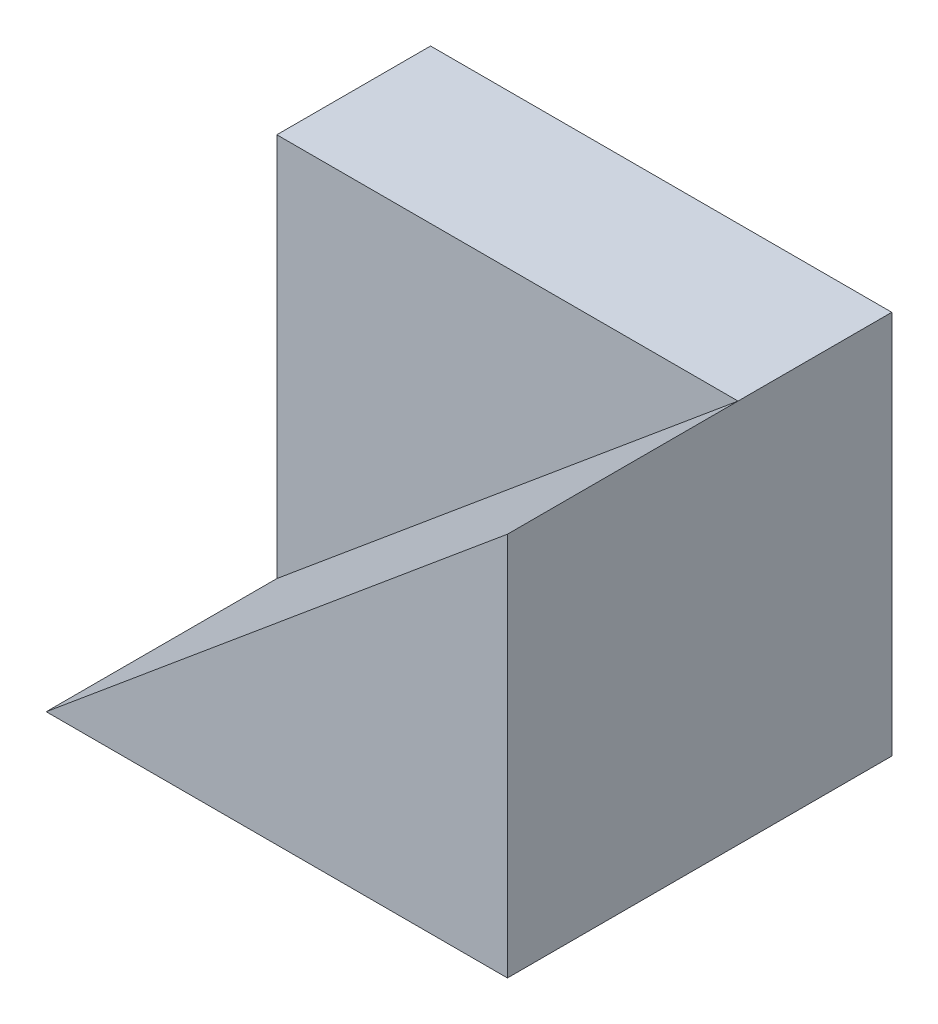
ISO-10303-21;
HEADER;
FILE_DESCRIPTION(('STEP AP214'),'2;1');
FILE_NAME('part.step','',(''),(''),'','','');
FILE_SCHEMA(('AUTOMOTIVE_DESIGN { 1 0 10303 214 1 1 1 1 }'));
ENDSEC;
DATA;
#1=APPLICATION_CONTEXT('core data for automotive mechanical design processes');
#2=APPLICATION_PROTOCOL_DEFINITION('international standard','automotive_design',2000,#1);
#3=PRODUCT_CONTEXT('',#1,'mechanical');
#4=PRODUCT('Part','Part','',(#3));
#5=PRODUCT_RELATED_PRODUCT_CATEGORY('part','',(#4));
#6=PRODUCT_DEFINITION_FORMATION('','',#4);
#7=PRODUCT_DEFINITION_CONTEXT('part definition',#1,'design');
#8=PRODUCT_DEFINITION('design','',#6,#7);
#9=PRODUCT_DEFINITION_SHAPE('','',#8);
#10=(LENGTH_UNIT() NAMED_UNIT(*) SI_UNIT(.MILLI.,.METRE.));
#11=(NAMED_UNIT(*) PLANE_ANGLE_UNIT() SI_UNIT($,.RADIAN.));
#12=(NAMED_UNIT(*) SI_UNIT($,.STERADIAN.) SOLID_ANGLE_UNIT());
#13=UNCERTAINTY_MEASURE_WITH_UNIT(LENGTH_MEASURE(1.E-05),#10,'distance_accuracy_value','');
#14=(GEOMETRIC_REPRESENTATION_CONTEXT(3) GLOBAL_UNCERTAINTY_ASSIGNED_CONTEXT((#13)) GLOBAL_UNIT_ASSIGNED_CONTEXT((#10,
#11,#12)) REPRESENTATION_CONTEXT('',''));
#15=CARTESIAN_POINT('',(0.,0.,0.));
#16=DIRECTION('',(0.,0.,1.));
#17=DIRECTION('',(1.,0.,0.));
#18=AXIS2_PLACEMENT_3D('',#15,#16,#17);
#19=CARTESIAN_POINT('',(0.,0.,10.));
#20=DIRECTION('',(0.,0.,-1.));
#21=DIRECTION('',(-1.,0.,0.));
#22=AXIS2_PLACEMENT_3D('',#19,#20,#21);
#23=PLANE('',#22);
#24=DIRECTION('',(-0.768221279597376,-0.64018439966448,0.));
#25=VECTOR('',#24,1.);
#26=CARTESIAN_POINT('',(-30.,0.,10.));
#27=LINE('',#26,#25);
#28=CARTESIAN_POINT('',(0.,25.,10.));
#29=VERTEX_POINT('',#28);
#30=CARTESIAN_POINT('',(-30.,0.,10.));
#31=VERTEX_POINT('',#30);
#32=EDGE_CURVE('E127',#29,#31,#27,.T.);
#33=ORIENTED_EDGE('',*,*,#32,.F.);
#34=DIRECTION('',(-1.,0.,0.));
#35=VECTOR('',#34,1.);
#36=CARTESIAN_POINT('',(-30.,25.,10.));
#37=LINE('',#36,#35);
#38=CARTESIAN_POINT('',(-30.,25.,10.));
#39=VERTEX_POINT('',#38);
#40=EDGE_CURVE('E50',#29,#39,#37,.T.);
#41=ORIENTED_EDGE('',*,*,#40,.T.);
#42=DIRECTION('',(0.,-1.,0.));
#43=VECTOR('',#42,1.);
#44=CARTESIAN_POINT('',(-30.,0.,10.));
#45=LINE('',#44,#43);
#46=EDGE_CURVE('E80',#39,#31,#45,.T.);
#47=ORIENTED_EDGE('',*,*,#46,.T.);
#48=EDGE_LOOP('',(#33,#41,#47));
#49=FACE_BOUND('',#48,.T.);
#50=ADVANCED_FACE('F33',(#49),#23,.F.);
#51=CARTESIAN_POINT('',(-30.,0.,10.));
#52=DIRECTION('',(1.,0.,0.));
#53=DIRECTION('',(0.,1.,0.));
#54=AXIS2_PLACEMENT_3D('',#51,#52,#53);
#55=PLANE('',#54);
#56=DIRECTION('',(0.,-1.,0.));
#57=VECTOR('',#56,1.);
#58=CARTESIAN_POINT('',(-30.,0.,0.));
#59=LINE('',#58,#57);
#60=CARTESIAN_POINT('',(-30.,25.,0.));
#61=VERTEX_POINT('',#60);
#62=CARTESIAN_POINT('',(-30.,0.,0.));
#63=VERTEX_POINT('',#62);
#64=EDGE_CURVE('E85',#61,#63,#59,.T.);
#65=ORIENTED_EDGE('',*,*,#64,.T.);
#66=DIRECTION('',(0.,0.,-1.));
#67=VECTOR('',#66,1.);
#68=CARTESIAN_POINT('',(-30.,0.,10.));
#69=LINE('',#68,#67);
#70=EDGE_CURVE('E11',#31,#63,#69,.T.);
#71=ORIENTED_EDGE('',*,*,#70,.F.);
#72=ORIENTED_EDGE('',*,*,#46,.F.);
#73=DIRECTION('',(0.,0.,-1.));
#74=VECTOR('',#73,1.);
#75=CARTESIAN_POINT('',(-30.,25.,10.));
#76=LINE('',#75,#74);
#77=EDGE_CURVE('E75',#39,#61,#76,.T.);
#78=ORIENTED_EDGE('',*,*,#77,.T.);
#79=EDGE_LOOP('',(#65,#71,#72,#78));
#80=FACE_BOUND('',#79,.T.);
#81=ADVANCED_FACE('F35',(#80),#55,.F.);
#82=CARTESIAN_POINT('',(0.,0.,10.));
#83=DIRECTION('',(0.,1.,0.));
#84=DIRECTION('',(-1.,0.,0.));
#85=AXIS2_PLACEMENT_3D('',#82,#83,#84);
#86=PLANE('',#85);
#87=DIRECTION('',(1.,0.,0.));
#88=VECTOR('',#87,1.);
#89=CARTESIAN_POINT('',(0.,0.,0.));
#90=LINE('',#89,#88);
#91=CARTESIAN_POINT('',(0.,0.,0.));
#92=VERTEX_POINT('',#91);
#93=EDGE_CURVE('E88',#63,#92,#90,.T.);
#94=ORIENTED_EDGE('',*,*,#93,.T.);
#95=DIRECTION('',(0.,0.,-1.));
#96=VECTOR('',#95,1.);
#97=CARTESIAN_POINT('',(0.,0.,10.));
#98=LINE('',#97,#96);
#99=CARTESIAN_POINT('',(0.,0.,25.));
#100=VERTEX_POINT('',#99);
#101=EDGE_CURVE('E42',#100,#92,#98,.T.);
#102=ORIENTED_EDGE('',*,*,#101,.F.);
#103=DIRECTION('',(1.,0.,0.));
#104=VECTOR('',#103,1.);
#105=CARTESIAN_POINT('',(0.,0.,25.));
#106=LINE('',#105,#104);
#107=CARTESIAN_POINT('',(-30.,0.,25.));
#108=VERTEX_POINT('',#107);
#109=EDGE_CURVE('E111',#108,#100,#106,.T.);
#110=ORIENTED_EDGE('',*,*,#109,.F.);
#111=DIRECTION('',(0.,0.,-1.));
#112=VECTOR('',#111,1.);
#113=CARTESIAN_POINT('',(-30.,0.,25.));
#114=LINE('',#113,#112);
#115=EDGE_CURVE('E93',#108,#31,#114,.T.);
#116=ORIENTED_EDGE('',*,*,#115,.T.);
#117=ORIENTED_EDGE('',*,*,#70,.T.);
#118=EDGE_LOOP('',(#94,#102,#110,#116,#117));
#119=FACE_BOUND('',#118,.T.);
#120=ADVANCED_FACE('F109',(#119),#86,.F.);
#121=CARTESIAN_POINT('',(0.,25.,10.));
#122=DIRECTION('',(-1.,0.,0.));
#123=DIRECTION('',(0.,0.,1.));
#124=AXIS2_PLACEMENT_3D('',#121,#122,#123);
#125=PLANE('',#124);
#126=DIRECTION('',(0.,1.,0.));
#127=VECTOR('',#126,1.);
#128=CARTESIAN_POINT('',(0.,25.,0.));
#129=LINE('',#128,#127);
#130=CARTESIAN_POINT('',(0.,25.,0.));
#131=VERTEX_POINT('',#130);
#132=EDGE_CURVE('E67',#92,#131,#129,.T.);
#133=ORIENTED_EDGE('',*,*,#132,.T.);
#134=DIRECTION('',(0.,0.,-1.));
#135=VECTOR('',#134,1.);
#136=CARTESIAN_POINT('',(0.,25.,10.));
#137=LINE('',#136,#135);
#138=EDGE_CURVE('E77',#29,#131,#137,.T.);
#139=ORIENTED_EDGE('',*,*,#138,.F.);
#140=DIRECTION('',(0.,0.,-1.));
#141=VECTOR('',#140,1.);
#142=CARTESIAN_POINT('',(0.,25.,25.));
#143=LINE('',#142,#141);
#144=CARTESIAN_POINT('',(0.,25.,25.));
#145=VERTEX_POINT('',#144);
#146=EDGE_CURVE('E89',#145,#29,#143,.T.);
#147=ORIENTED_EDGE('',*,*,#146,.F.);
#148=DIRECTION('',(0.,1.,0.));
#149=VECTOR('',#148,1.);
#150=CARTESIAN_POINT('',(0.,25.,25.));
#151=LINE('',#150,#149);
#152=EDGE_CURVE('E105',#100,#145,#151,.T.);
#153=ORIENTED_EDGE('',*,*,#152,.F.);
#154=ORIENTED_EDGE('',*,*,#101,.T.);
#155=EDGE_LOOP('',(#133,#139,#147,#153,#154));
#156=FACE_BOUND('',#155,.T.);
#157=ADVANCED_FACE('F101',(#156),#125,.F.);
#158=CARTESIAN_POINT('',(-30.,25.,10.));
#159=DIRECTION('',(0.,-1.,0.));
#160=DIRECTION('',(0.,0.,-1.));
#161=AXIS2_PLACEMENT_3D('',#158,#159,#160);
#162=PLANE('',#161);
#163=DIRECTION('',(-1.,0.,0.));
#164=VECTOR('',#163,1.);
#165=CARTESIAN_POINT('',(-30.,25.,0.));
#166=LINE('',#165,#164);
#167=EDGE_CURVE('E72',#131,#61,#166,.T.);
#168=ORIENTED_EDGE('',*,*,#167,.T.);
#169=ORIENTED_EDGE('',*,*,#77,.F.);
#170=ORIENTED_EDGE('',*,*,#40,.F.);
#171=ORIENTED_EDGE('',*,*,#138,.T.);
#172=EDGE_LOOP('',(#168,#169,#170,#171));
#173=FACE_BOUND('',#172,.T.);
#174=ADVANCED_FACE('F74',(#173),#162,.F.);
#175=CARTESIAN_POINT('',(0.,0.,0.));
#176=DIRECTION('',(0.,0.,-1.));
#177=DIRECTION('',(-1.,0.,0.));
#178=AXIS2_PLACEMENT_3D('',#175,#176,#177);
#179=PLANE('',#178);
#180=ORIENTED_EDGE('',*,*,#64,.F.);
#181=ORIENTED_EDGE('',*,*,#167,.F.);
#182=ORIENTED_EDGE('',*,*,#132,.F.);
#183=ORIENTED_EDGE('',*,*,#93,.F.);
#184=EDGE_LOOP('',(#180,#181,#182,#183));
#185=FACE_BOUND('',#184,.T.);
#186=ADVANCED_FACE('F87',(#185),#179,.T.);
#187=CARTESIAN_POINT('',(-30.,0.,25.));
#188=DIRECTION('',(0.64018439966448,-0.768221279597376,0.));
#189=DIRECTION('',(0.768221279597376,0.64018439966448,0.));
#190=AXIS2_PLACEMENT_3D('',#187,#188,#189);
#191=PLANE('',#190);
#192=ORIENTED_EDGE('',*,*,#32,.T.);
#193=ORIENTED_EDGE('',*,*,#115,.F.);
#194=DIRECTION('',(-0.768221279597376,-0.64018439966448,0.));
#195=VECTOR('',#194,1.);
#196=CARTESIAN_POINT('',(-30.,0.,25.));
#197=LINE('',#196,#195);
#198=EDGE_CURVE('E120',#145,#108,#197,.T.);
#199=ORIENTED_EDGE('',*,*,#198,.F.);
#200=ORIENTED_EDGE('',*,*,#146,.T.);
#201=EDGE_LOOP('',(#192,#193,#199,#200));
#202=FACE_BOUND('',#201,.T.);
#203=ADVANCED_FACE('F126',(#202),#191,.F.);
#204=CARTESIAN_POINT('',(0.,0.,25.));
#205=DIRECTION('',(0.,0.,1.));
#206=DIRECTION('',(1.,0.,0.));
#207=AXIS2_PLACEMENT_3D('',#204,#205,#206);
#208=PLANE('',#207);
#209=ORIENTED_EDGE('',*,*,#109,.T.);
#210=ORIENTED_EDGE('',*,*,#152,.T.);
#211=ORIENTED_EDGE('',*,*,#198,.T.);
#212=EDGE_LOOP('',(#209,#210,#211));
#213=FACE_BOUND('',#212,.T.);
#214=ADVANCED_FACE('F122',(#213),#208,.T.);
#215=CLOSED_SHELL('',(#50,#81,#120,#157,#174,#186,#203,#214));
#216=MANIFOLD_SOLID_BREP('B2',#215);
#217=ADVANCED_BREP_SHAPE_REPRESENTATION('',(#18,#216),#14);
#218=SHAPE_DEFINITION_REPRESENTATION(#9,#217);
ENDSEC;
END-ISO-10303-21;
